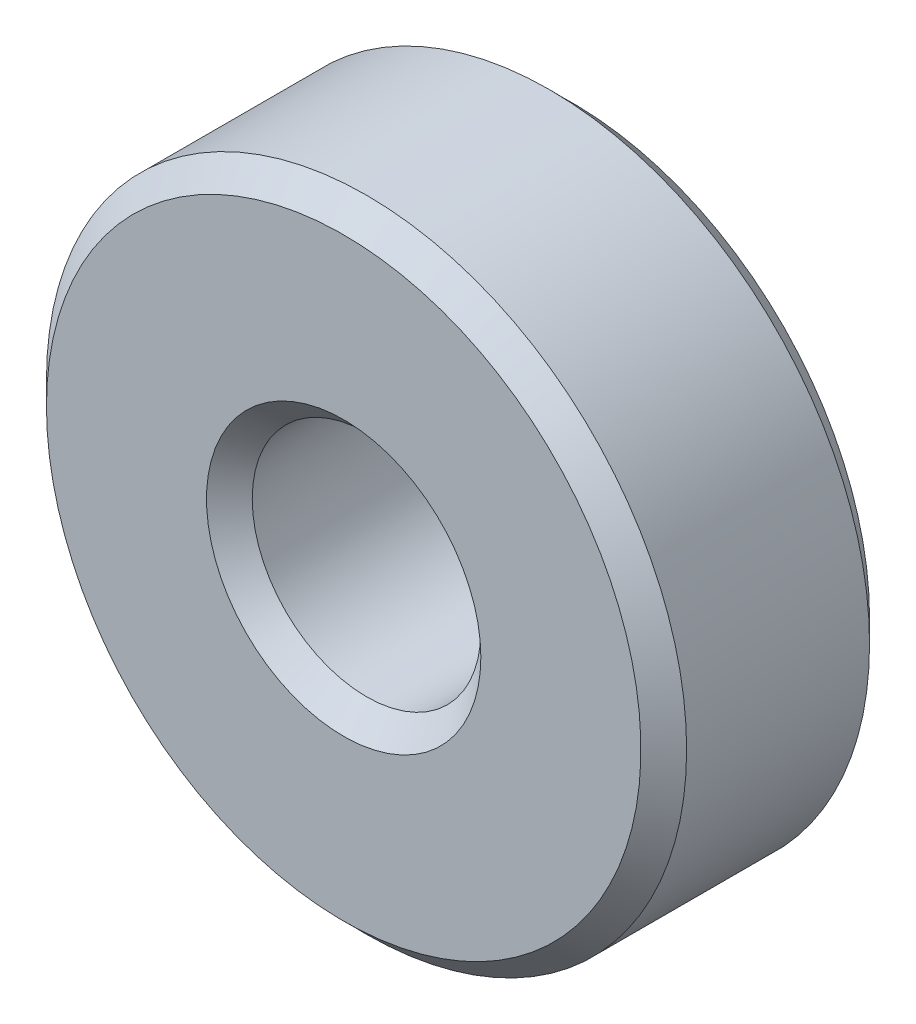
ISO-10303-21;
HEADER;
FILE_DESCRIPTION(('STEP AP214'),'2;1');
FILE_NAME('part.step','',(''),(''),'','','');
FILE_SCHEMA(('AUTOMOTIVE_DESIGN { 1 0 10303 214 1 1 1 1 }'));
ENDSEC;
DATA;
#1=APPLICATION_CONTEXT('core data for automotive mechanical design processes');
#2=APPLICATION_PROTOCOL_DEFINITION('international standard','automotive_design',2000,#1);
#3=PRODUCT_CONTEXT('',#1,'mechanical');
#4=PRODUCT('Part','Part','',(#3));
#5=PRODUCT_RELATED_PRODUCT_CATEGORY('part','',(#4));
#6=PRODUCT_DEFINITION_FORMATION('','',#4);
#7=PRODUCT_DEFINITION_CONTEXT('part definition',#1,'design');
#8=PRODUCT_DEFINITION('design','',#6,#7);
#9=PRODUCT_DEFINITION_SHAPE('','',#8);
#10=(LENGTH_UNIT() NAMED_UNIT(*) SI_UNIT(.MILLI.,.METRE.));
#11=(NAMED_UNIT(*) PLANE_ANGLE_UNIT() SI_UNIT($,.RADIAN.));
#12=(NAMED_UNIT(*) SI_UNIT($,.STERADIAN.) SOLID_ANGLE_UNIT());
#13=UNCERTAINTY_MEASURE_WITH_UNIT(LENGTH_MEASURE(1.E-05),#10,'distance_accuracy_value','');
#14=(GEOMETRIC_REPRESENTATION_CONTEXT(3) GLOBAL_UNCERTAINTY_ASSIGNED_CONTEXT((#13)) GLOBAL_UNIT_ASSIGNED_CONTEXT((#10,
#11,#12)) REPRESENTATION_CONTEXT('',''));
#15=CARTESIAN_POINT('',(0.,0.,0.));
#16=DIRECTION('',(0.,0.,1.));
#17=DIRECTION('',(1.,0.,0.));
#18=AXIS2_PLACEMENT_3D('',#15,#16,#17);
#19=CARTESIAN_POINT('',(0.,0.,0.));
#20=DIRECTION('',(0.,0.,1.));
#21=DIRECTION('',(1.,0.,0.));
#22=AXIS2_PLACEMENT_3D('',#19,#20,#21);
#23=PLANE('',#22);
#24=CARTESIAN_POINT('',(0.,0.,0.));
#25=DIRECTION('',(0.,0.,1.));
#26=DIRECTION('',(1.,0.,0.));
#27=AXIS2_PLACEMENT_3D('',#24,#25,#26);
#28=CIRCLE('',#27,6.5);
#29=CARTESIAN_POINT('',(6.5,0.,0.));
#30=VERTEX_POINT('',#29);
#31=EDGE_CURVE('E32',#30,#30,#28,.T.);
#32=ORIENTED_EDGE('',*,*,#31,.F.);
#33=EDGE_LOOP('',(#32));
#34=FACE_BOUND('',#33,.T.);
#35=CARTESIAN_POINT('',(0.,0.,-5.6843418860808E-11));
#36=DIRECTION('',(0.,0.,-1.));
#37=DIRECTION('',(-1.,0.,0.));
#38=AXIS2_PLACEMENT_3D('',#35,#36,#37);
#39=CIRCLE('',#38,2.9999999999859);
#40=CARTESIAN_POINT('',(-2.9999999999859,0.,-5.6843418860808E-11));
#41=VERTEX_POINT('',#40);
#42=EDGE_CURVE('E18',#41,#41,#39,.F.);
#43=ORIENTED_EDGE('',*,*,#42,.T.);
#44=EDGE_LOOP('',(#43));
#45=FACE_BOUND('',#44,.T.);
#46=ADVANCED_FACE('F15',(#34,#45),#23,.F.);
#47=CARTESIAN_POINT('',(0.,0.,-5.6843418860808E-11));
#48=DIRECTION('',(0.,0.,-1.));
#49=DIRECTION('',(-1.,0.,0.));
#50=AXIS2_PLACEMENT_3D('',#47,#48,#49);
#51=CONICAL_SURFACE('',#50,2.9999999999859,0.785398163397448);
#52=CARTESIAN_POINT('',(0.,0.,0.500000000000007));
#53=DIRECTION('',(0.,0.,-1.));
#54=DIRECTION('',(0.,1.,0.));
#55=AXIS2_PLACEMENT_3D('',#52,#53,#54);
#56=CIRCLE('',#55,2.5);
#57=CARTESIAN_POINT('',(0.,2.5,0.500000000000007));
#58=VERTEX_POINT('',#57);
#59=EDGE_CURVE('E30',#58,#58,#56,.F.);
#60=ORIENTED_EDGE('',*,*,#59,.T.);
#61=EDGE_LOOP('',(#60));
#62=FACE_BOUND('',#61,.T.);
#63=ORIENTED_EDGE('',*,*,#42,.F.);
#64=EDGE_LOOP('',(#63));
#65=FACE_BOUND('',#64,.T.);
#66=ADVANCED_FACE('F42',(#62,#65),#51,.F.);
#67=CARTESIAN_POINT('',(0.,0.,0.500000000000001));
#68=DIRECTION('',(0.,0.,1.));
#69=DIRECTION('',(1.,0.,0.));
#70=AXIS2_PLACEMENT_3D('',#67,#68,#69);
#71=CONICAL_SURFACE('',#70,7.,0.78539816339745);
#72=CARTESIAN_POINT('',(0.,0.,0.5));
#73=DIRECTION('',(0.,0.,-1.));
#74=DIRECTION('',(0.,1.,0.));
#75=AXIS2_PLACEMENT_3D('',#72,#73,#74);
#76=CIRCLE('',#75,7.);
#77=CARTESIAN_POINT('',(0.,7.,0.5));
#78=VERTEX_POINT('',#77);
#79=EDGE_CURVE('E37',#78,#78,#76,.F.);
#80=ORIENTED_EDGE('',*,*,#79,.F.);
#81=EDGE_LOOP('',(#80));
#82=FACE_BOUND('',#81,.T.);
#83=ORIENTED_EDGE('',*,*,#31,.T.);
#84=EDGE_LOOP('',(#83));
#85=FACE_BOUND('',#84,.T.);
#86=ADVANCED_FACE('F44',(#82,#85),#71,.T.);
#87=CARTESIAN_POINT('',(0.,0.,5.));
#88=DIRECTION('',(0.,0.,-1.));
#89=DIRECTION('',(0.,1.,0.));
#90=AXIS2_PLACEMENT_3D('',#87,#88,#89);
#91=CYLINDRICAL_SURFACE('',#90,2.5);
#92=CARTESIAN_POINT('',(0.,0.,4.49999999995043));
#93=DIRECTION('',(0.,0.,1.));
#94=DIRECTION('',(1.,0.,0.));
#95=AXIS2_PLACEMENT_3D('',#92,#93,#94);
#96=CIRCLE('',#95,2.49999999994088);
#97=CARTESIAN_POINT('',(2.49999999994088,0.,4.49999999995043));
#98=VERTEX_POINT('',#97);
#99=EDGE_CURVE('E82',#98,#98,#96,.T.);
#100=ORIENTED_EDGE('',*,*,#99,.T.);
#101=EDGE_LOOP('',(#100));
#102=FACE_BOUND('',#101,.T.);
#103=ORIENTED_EDGE('',*,*,#59,.F.);
#104=EDGE_LOOP('',(#103));
#105=FACE_BOUND('',#104,.T.);
#106=ADVANCED_FACE('F51',(#102,#105),#91,.F.);
#107=CARTESIAN_POINT('',(0.,0.,5.));
#108=DIRECTION('',(0.,0.,-1.));
#109=DIRECTION('',(0.,1.,0.));
#110=AXIS2_PLACEMENT_3D('',#107,#108,#109);
#111=CYLINDRICAL_SURFACE('',#110,7.);
#112=ORIENTED_EDGE('',*,*,#79,.T.);
#113=EDGE_LOOP('',(#112));
#114=FACE_BOUND('',#113,.T.);
#115=CARTESIAN_POINT('',(0.,0.,4.50000000000728));
#116=DIRECTION('',(0.,0.,-1.));
#117=DIRECTION('',(-1.,0.,0.));
#118=AXIS2_PLACEMENT_3D('',#115,#116,#117);
#119=CIRCLE('',#118,7.000000000005);
#120=CARTESIAN_POINT('',(-7.000000000005,0.,4.50000000000728));
#121=VERTEX_POINT('',#120);
#122=EDGE_CURVE('E27',#121,#121,#119,.F.);
#123=ORIENTED_EDGE('',*,*,#122,.F.);
#124=EDGE_LOOP('',(#123));
#125=FACE_BOUND('',#124,.T.);
#126=ADVANCED_FACE('F70',(#114,#125),#111,.T.);
#127=CARTESIAN_POINT('',(0.,0.,5.0000000000523));
#128=DIRECTION('',(0.,0.,1.));
#129=DIRECTION('',(1.,0.,0.));
#130=AXIS2_PLACEMENT_3D('',#127,#128,#129);
#131=CONICAL_SURFACE('',#130,3.00000000004275,0.785398163397448);
#132=ORIENTED_EDGE('',*,*,#99,.F.);
#133=EDGE_LOOP('',(#132));
#134=FACE_BOUND('',#133,.T.);
#135=CARTESIAN_POINT('',(0.,0.,5.0000000000523));
#136=DIRECTION('',(0.,0.,1.));
#137=DIRECTION('',(1.,0.,0.));
#138=AXIS2_PLACEMENT_3D('',#135,#136,#137);
#139=CIRCLE('',#138,3.00000000004275);
#140=CARTESIAN_POINT('',(3.00000000004275,0.,5.0000000000523));
#141=VERTEX_POINT('',#140);
#142=EDGE_CURVE('E22',#141,#141,#139,.F.);
#143=ORIENTED_EDGE('',*,*,#142,.F.);
#144=EDGE_LOOP('',(#143));
#145=FACE_BOUND('',#144,.T.);
#146=ADVANCED_FACE('F63',(#134,#145),#131,.F.);
#147=CARTESIAN_POINT('',(0.,0.,4.50000000017781));
#148=DIRECTION('',(0.,0.,-1.));
#149=DIRECTION('',(-1.,0.,0.));
#150=AXIS2_PLACEMENT_3D('',#147,#148,#149);
#151=CONICAL_SURFACE('',#150,6.99999999983447,0.785398163397448);
#152=ORIENTED_EDGE('',*,*,#122,.T.);
#153=EDGE_LOOP('',(#152));
#154=FACE_BOUND('',#153,.T.);
#155=CARTESIAN_POINT('',(0.,0.,4.99999999999545));
#156=DIRECTION('',(0.,0.,-1.));
#157=DIRECTION('',(-1.,0.,0.));
#158=AXIS2_PLACEMENT_3D('',#155,#156,#157);
#159=CIRCLE('',#158,6.50000000001683);
#160=CARTESIAN_POINT('',(-6.50000000001683,0.,4.99999999999545));
#161=VERTEX_POINT('',#160);
#162=EDGE_CURVE('E10',#161,#161,#159,.F.);
#163=ORIENTED_EDGE('',*,*,#162,.F.);
#164=EDGE_LOOP('',(#163));
#165=FACE_BOUND('',#164,.T.);
#166=ADVANCED_FACE('F58',(#154,#165),#151,.T.);
#167=CARTESIAN_POINT('',(0.,0.,5.));
#168=DIRECTION('',(0.,0.,1.));
#169=DIRECTION('',(1.,0.,0.));
#170=AXIS2_PLACEMENT_3D('',#167,#168,#169);
#171=PLANE('',#170);
#172=ORIENTED_EDGE('',*,*,#162,.T.);
#173=EDGE_LOOP('',(#172));
#174=FACE_BOUND('',#173,.T.);
#175=ORIENTED_EDGE('',*,*,#142,.T.);
#176=EDGE_LOOP('',(#175));
#177=FACE_BOUND('',#176,.T.);
#178=ADVANCED_FACE('F56',(#174,#177),#171,.T.);
#179=CLOSED_SHELL('',(#46,#66,#86,#106,#126,#146,#166,#178));
#180=MANIFOLD_SOLID_BREP('B1',#179);
#181=ADVANCED_BREP_SHAPE_REPRESENTATION('',(#18,#180),#14);
#182=SHAPE_DEFINITION_REPRESENTATION(#9,#181);
ENDSEC;
END-ISO-10303-21;
